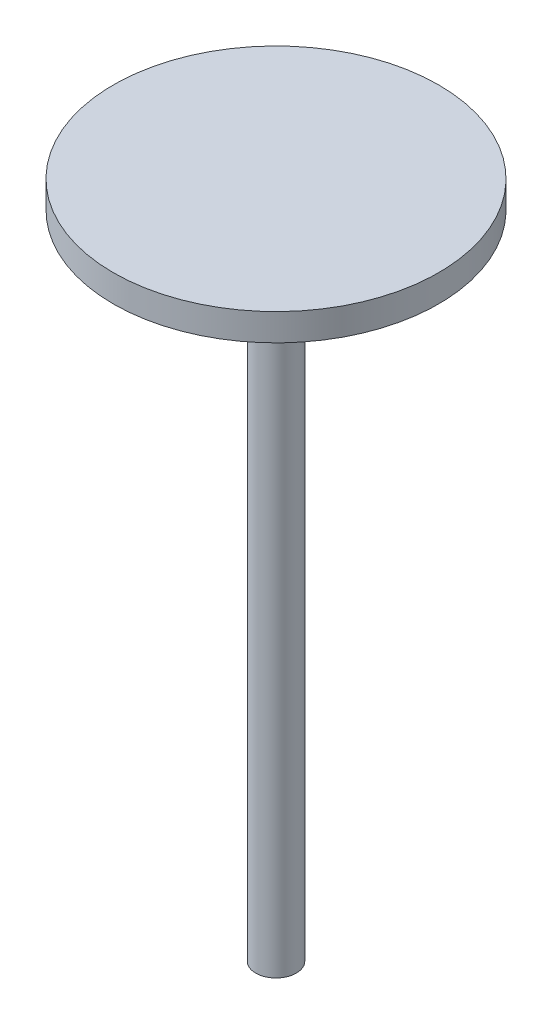
ISO-10303-21;
HEADER;
FILE_DESCRIPTION(('STEP AP214'),'2;1');
FILE_NAME('part.step','',(''),(''),'','','');
FILE_SCHEMA(('AUTOMOTIVE_DESIGN { 1 0 10303 214 1 1 1 1 }'));
ENDSEC;
DATA;
#1=APPLICATION_CONTEXT('core data for automotive mechanical design processes');
#2=APPLICATION_PROTOCOL_DEFINITION('international standard','automotive_design',2000,#1);
#3=PRODUCT_CONTEXT('',#1,'mechanical');
#4=PRODUCT('Part','Part','',(#3));
#5=PRODUCT_RELATED_PRODUCT_CATEGORY('part','',(#4));
#6=PRODUCT_DEFINITION_FORMATION('','',#4);
#7=PRODUCT_DEFINITION_CONTEXT('part definition',#1,'design');
#8=PRODUCT_DEFINITION('design','',#6,#7);
#9=PRODUCT_DEFINITION_SHAPE('','',#8);
#10=(LENGTH_UNIT() NAMED_UNIT(*) SI_UNIT(.MILLI.,.METRE.));
#11=(NAMED_UNIT(*) PLANE_ANGLE_UNIT() SI_UNIT($,.RADIAN.));
#12=(NAMED_UNIT(*) SI_UNIT($,.STERADIAN.) SOLID_ANGLE_UNIT());
#13=UNCERTAINTY_MEASURE_WITH_UNIT(LENGTH_MEASURE(1.E-05),#10,'distance_accuracy_value','');
#14=(GEOMETRIC_REPRESENTATION_CONTEXT(3) GLOBAL_UNCERTAINTY_ASSIGNED_CONTEXT((#13)) GLOBAL_UNIT_ASSIGNED_CONTEXT((#10,
#11,#12)) REPRESENTATION_CONTEXT('',''));
#15=CARTESIAN_POINT('',(0.,0.,0.));
#16=DIRECTION('',(0.,0.,1.));
#17=DIRECTION('',(1.,0.,0.));
#18=AXIS2_PLACEMENT_3D('',#15,#16,#17);
#19=CARTESIAN_POINT('',(0.,311.15,0.));
#20=DIRECTION('',(0.,1.,0.));
#21=DIRECTION('',(0.,0.,1.));
#22=AXIS2_PLACEMENT_3D('',#19,#20,#21);
#23=PLANE('',#22);
#24=CARTESIAN_POINT('',(0.,311.15,0.));
#25=DIRECTION('',(0.,1.,0.));
#26=DIRECTION('',(0.,0.,1.));
#27=AXIS2_PLACEMENT_3D('',#24,#25,#26);
#28=CIRCLE('',#27,28.2575);
#29=CARTESIAN_POINT('',(0.,311.15,28.2575));
#30=VERTEX_POINT('',#29);
#31=EDGE_CURVE('E42',#30,#30,#28,.T.);
#32=ORIENTED_EDGE('',*,*,#31,.T.);
#33=EDGE_LOOP('',(#32));
#34=FACE_BOUND('',#33,.T.);
#35=CARTESIAN_POINT('',(0.,311.15,0.));
#36=DIRECTION('',(0.,-1.,0.));
#37=DIRECTION('',(0.,0.,-1.));
#38=AXIS2_PLACEMENT_3D('',#35,#36,#37);
#39=CIRCLE('',#38,70.1675);
#40=CARTESIAN_POINT('',(0.,311.15,-70.1675));
#41=VERTEX_POINT('',#40);
#42=EDGE_CURVE('E56',#41,#41,#39,.T.);
#43=ORIENTED_EDGE('',*,*,#42,.T.);
#44=EDGE_LOOP('',(#43));
#45=FACE_BOUND('',#44,.T.);
#46=ADVANCED_FACE('F31',(#34,#45),#23,.F.);
#47=CARTESIAN_POINT('',(0.,304.8,0.));
#48=DIRECTION('',(0.,-1.,0.));
#49=DIRECTION('',(0.,0.,-1.));
#50=AXIS2_PLACEMENT_3D('',#47,#48,#49);
#51=CYLINDRICAL_SURFACE('',#50,9.525);
#52=CARTESIAN_POINT('',(0.,304.8,0.));
#53=DIRECTION('',(0.,1.,0.));
#54=DIRECTION('',(0.,0.,1.));
#55=AXIS2_PLACEMENT_3D('',#52,#53,#54);
#56=CIRCLE('',#55,9.525);
#57=CARTESIAN_POINT('',(0.,304.8,9.525));
#58=VERTEX_POINT('',#57);
#59=EDGE_CURVE('E10',#58,#58,#56,.T.);
#60=ORIENTED_EDGE('',*,*,#59,.F.);
#61=EDGE_LOOP('',(#60));
#62=FACE_BOUND('',#61,.T.);
#63=CARTESIAN_POINT('',(0.,0.,0.));
#64=DIRECTION('',(0.,1.,0.));
#65=DIRECTION('',(0.,0.,1.));
#66=AXIS2_PLACEMENT_3D('',#63,#64,#65);
#67=CIRCLE('',#66,9.525);
#68=CARTESIAN_POINT('',(0.,0.,9.525));
#69=VERTEX_POINT('',#68);
#70=EDGE_CURVE('E35',#69,#69,#67,.T.);
#71=ORIENTED_EDGE('',*,*,#70,.T.);
#72=EDGE_LOOP('',(#71));
#73=FACE_BOUND('',#72,.T.);
#74=ADVANCED_FACE('F33',(#62,#73),#51,.T.);
#75=CARTESIAN_POINT('',(0.,0.,0.));
#76=DIRECTION('',(0.,1.,0.));
#77=DIRECTION('',(0.,0.,1.));
#78=AXIS2_PLACEMENT_3D('',#75,#76,#77);
#79=PLANE('',#78);
#80=ORIENTED_EDGE('',*,*,#70,.F.);
#81=EDGE_LOOP('',(#80));
#82=FACE_BOUND('',#81,.T.);
#83=ADVANCED_FACE('F85',(#82),#79,.F.);
#84=CARTESIAN_POINT('',(0.,311.15,0.));
#85=DIRECTION('',(0.,-1.,0.));
#86=DIRECTION('',(0.,0.,-1.));
#87=AXIS2_PLACEMENT_3D('',#84,#85,#86);
#88=CYLINDRICAL_SURFACE('',#87,28.2575);
#89=ORIENTED_EDGE('',*,*,#31,.F.);
#90=EDGE_LOOP('',(#89));
#91=FACE_BOUND('',#90,.T.);
#92=CARTESIAN_POINT('',(0.,304.8,0.));
#93=DIRECTION('',(0.,1.,0.));
#94=DIRECTION('',(0.,0.,1.));
#95=AXIS2_PLACEMENT_3D('',#92,#93,#94);
#96=CIRCLE('',#95,28.2575);
#97=CARTESIAN_POINT('',(0.,304.8,28.2575));
#98=VERTEX_POINT('',#97);
#99=EDGE_CURVE('E44',#98,#98,#96,.T.);
#100=ORIENTED_EDGE('',*,*,#99,.T.);
#101=EDGE_LOOP('',(#100));
#102=FACE_BOUND('',#101,.T.);
#103=ADVANCED_FACE('F76',(#91,#102),#88,.T.);
#104=CARTESIAN_POINT('',(0.,304.8,0.));
#105=DIRECTION('',(0.,1.,0.));
#106=DIRECTION('',(0.,0.,1.));
#107=AXIS2_PLACEMENT_3D('',#104,#105,#106);
#108=PLANE('',#107);
#109=ORIENTED_EDGE('',*,*,#59,.T.);
#110=EDGE_LOOP('',(#109));
#111=FACE_BOUND('',#110,.T.);
#112=ORIENTED_EDGE('',*,*,#99,.F.);
#113=EDGE_LOOP('',(#112));
#114=FACE_BOUND('',#113,.T.);
#115=ADVANCED_FACE('F67',(#111,#114),#108,.F.);
#116=CARTESIAN_POINT('',(0.,304.8,0.));
#117=DIRECTION('',(0.,-1.,0.));
#118=DIRECTION('',(0.,0.,-1.));
#119=AXIS2_PLACEMENT_3D('',#116,#117,#118);
#120=PLANE('',#119);
#121=CARTESIAN_POINT('',(0.,304.8,0.));
#122=DIRECTION('',(0.,-1.,0.));
#123=DIRECTION('',(0.,0.,-1.));
#124=AXIS2_PLACEMENT_3D('',#121,#122,#123);
#125=CIRCLE('',#124,76.2);
#126=CARTESIAN_POINT('',(0.,304.8,-76.2));
#127=VERTEX_POINT('',#126);
#128=EDGE_CURVE('E52',#127,#127,#125,.T.);
#129=ORIENTED_EDGE('',*,*,#128,.T.);
#130=EDGE_LOOP('',(#129));
#131=FACE_BOUND('',#130,.T.);
#132=CARTESIAN_POINT('',(0.,304.8,0.));
#133=DIRECTION('',(0.,-1.,0.));
#134=DIRECTION('',(0.,0.,-1.));
#135=AXIS2_PLACEMENT_3D('',#132,#133,#134);
#136=CIRCLE('',#135,70.1675);
#137=CARTESIAN_POINT('',(0.,304.8,-70.1675));
#138=VERTEX_POINT('',#137);
#139=EDGE_CURVE('E55',#138,#138,#136,.T.);
#140=ORIENTED_EDGE('',*,*,#139,.F.);
#141=EDGE_LOOP('',(#140));
#142=FACE_BOUND('',#141,.T.);
#143=ADVANCED_FACE('F65',(#131,#142),#120,.T.);
#144=CARTESIAN_POINT('',(0.,304.8,0.));
#145=DIRECTION('',(0.,1.,0.));
#146=DIRECTION('',(0.,0.,1.));
#147=AXIS2_PLACEMENT_3D('',#144,#145,#146);
#148=CYLINDRICAL_SURFACE('',#147,70.1675);
#149=ORIENTED_EDGE('',*,*,#139,.T.);
#150=EDGE_LOOP('',(#149));
#151=FACE_BOUND('',#150,.T.);
#152=ORIENTED_EDGE('',*,*,#42,.F.);
#153=EDGE_LOOP('',(#152));
#154=FACE_BOUND('',#153,.T.);
#155=ADVANCED_FACE('F62',(#151,#154),#148,.F.);
#156=CARTESIAN_POINT('',(0.,317.5,0.));
#157=DIRECTION('',(0.,1.,0.));
#158=DIRECTION('',(0.,0.,1.));
#159=AXIS2_PLACEMENT_3D('',#156,#157,#158);
#160=PLANE('',#159);
#161=CARTESIAN_POINT('',(0.,317.5,0.));
#162=DIRECTION('',(0.,1.,0.));
#163=DIRECTION('',(0.,0.,1.));
#164=AXIS2_PLACEMENT_3D('',#161,#162,#163);
#165=CIRCLE('',#164,76.2);
#166=CARTESIAN_POINT('',(0.,317.5,76.2));
#167=VERTEX_POINT('',#166);
#168=EDGE_CURVE('E47',#167,#167,#165,.T.);
#169=ORIENTED_EDGE('',*,*,#168,.T.);
#170=EDGE_LOOP('',(#169));
#171=FACE_BOUND('',#170,.T.);
#172=ADVANCED_FACE('F74',(#171),#160,.T.);
#173=CARTESIAN_POINT('',(0.,317.5,0.));
#174=DIRECTION('',(0.,-1.,0.));
#175=DIRECTION('',(0.,0.,-1.));
#176=AXIS2_PLACEMENT_3D('',#173,#174,#175);
#177=CYLINDRICAL_SURFACE('',#176,76.2);
#178=ORIENTED_EDGE('',*,*,#168,.F.);
#179=EDGE_LOOP('',(#178));
#180=FACE_BOUND('',#179,.T.);
#181=ORIENTED_EDGE('',*,*,#128,.F.);
#182=EDGE_LOOP('',(#181));
#183=FACE_BOUND('',#182,.T.);
#184=ADVANCED_FACE('F89',(#180,#183),#177,.T.);
#185=CLOSED_SHELL('',(#46,#74,#83,#103,#115,#143,#155,#172,#184));
#186=MANIFOLD_SOLID_BREP('B2',#185);
#187=ADVANCED_BREP_SHAPE_REPRESENTATION('',(#18,#186),#14);
#188=SHAPE_DEFINITION_REPRESENTATION(#9,#187);
ENDSEC;
END-ISO-10303-21;
